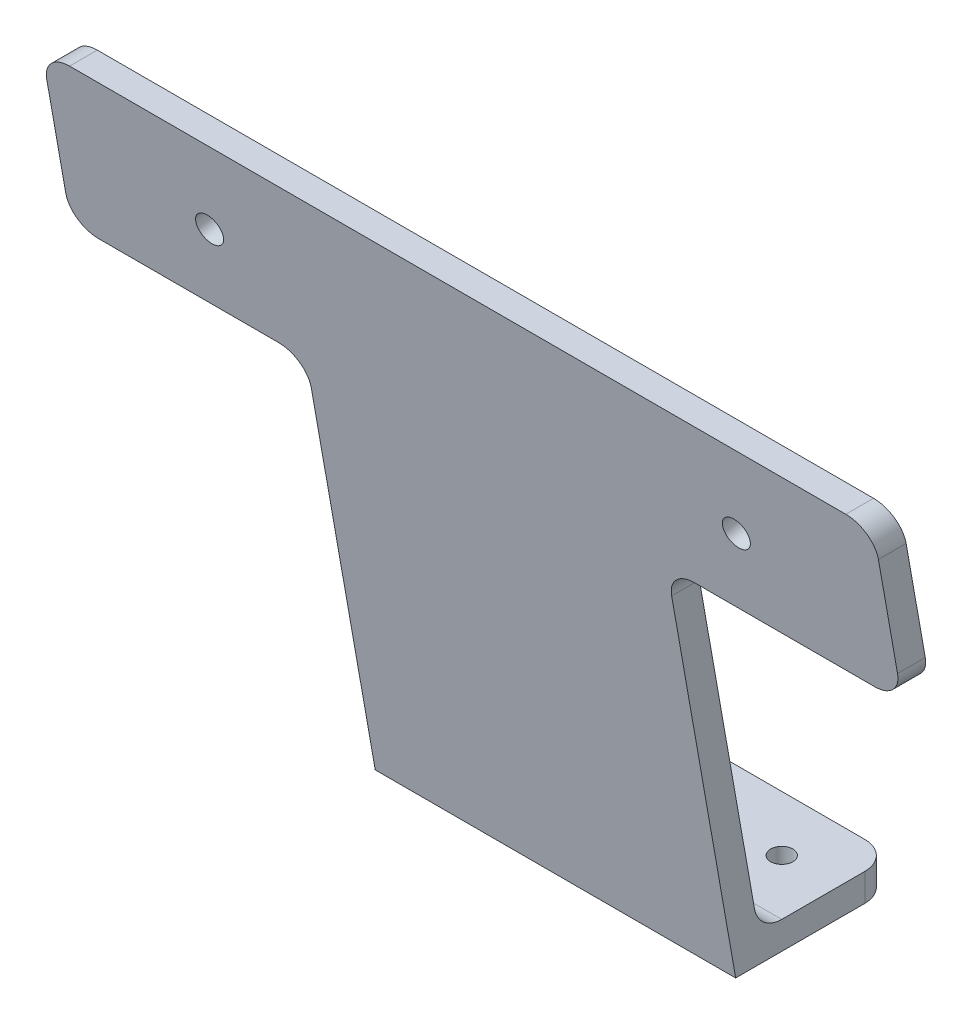
ISO-10303-21;
HEADER;
FILE_DESCRIPTION(('STEP AP214'),'2;1');
FILE_NAME('part.step','',(''),(''),'','','');
FILE_SCHEMA(('AUTOMOTIVE_DESIGN { 1 0 10303 214 1 1 1 1 }'));
ENDSEC;
DATA;
#1=APPLICATION_CONTEXT('core data for automotive mechanical design processes');
#2=APPLICATION_PROTOCOL_DEFINITION('international standard','automotive_design',2000,#1);
#3=PRODUCT_CONTEXT('',#1,'mechanical');
#4=PRODUCT('Part','Part','',(#3));
#5=PRODUCT_RELATED_PRODUCT_CATEGORY('part','',(#4));
#6=PRODUCT_DEFINITION_FORMATION('','',#4);
#7=PRODUCT_DEFINITION_CONTEXT('part definition',#1,'design');
#8=PRODUCT_DEFINITION('design','',#6,#7);
#9=PRODUCT_DEFINITION_SHAPE('','',#8);
#10=(LENGTH_UNIT() NAMED_UNIT(*) SI_UNIT(.MILLI.,.METRE.));
#11=(NAMED_UNIT(*) PLANE_ANGLE_UNIT() SI_UNIT($,.RADIAN.));
#12=(NAMED_UNIT(*) SI_UNIT($,.STERADIAN.) SOLID_ANGLE_UNIT());
#13=UNCERTAINTY_MEASURE_WITH_UNIT(LENGTH_MEASURE(1.E-05),#10,'distance_accuracy_value','');
#14=(GEOMETRIC_REPRESENTATION_CONTEXT(3) GLOBAL_UNCERTAINTY_ASSIGNED_CONTEXT((#13)) GLOBAL_UNIT_ASSIGNED_CONTEXT((#10,
#11,#12)) REPRESENTATION_CONTEXT('',''));
#15=CARTESIAN_POINT('',(0.,0.,0.));
#16=DIRECTION('',(0.,0.,1.));
#17=DIRECTION('',(1.,0.,0.));
#18=AXIS2_PLACEMENT_3D('',#15,#16,#17);
#19=CARTESIAN_POINT('',(65.,5.,-28.3));
#20=DIRECTION('',(0.,-1.,0.));
#21=DIRECTION('',(0.,0.,-1.));
#22=AXIS2_PLACEMENT_3D('',#19,#20,#21);
#23=PLANE('',#22);
#24=CARTESIAN_POINT('',(55.,5.,-18.3138632523441));
#25=DIRECTION('',(0.,1.,0.));
#26=DIRECTION('',(0.,0.,1.));
#27=AXIS2_PLACEMENT_3D('',#24,#25,#26);
#28=CIRCLE('',#27,2.);
#29=CARTESIAN_POINT('',(55.,5.,-16.3138632523441));
#30=VERTEX_POINT('',#29);
#31=EDGE_CURVE('E232',#30,#30,#28,.T.);
#32=ORIENTED_EDGE('',*,*,#31,.F.);
#33=EDGE_LOOP('',(#32));
#34=FACE_BOUND('',#33,.T.);
#35=CARTESIAN_POINT('',(10.,5.,-18.3138632523441));
#36=DIRECTION('',(0.,1.,0.));
#37=DIRECTION('',(0.,0.,1.));
#38=AXIS2_PLACEMENT_3D('',#35,#36,#37);
#39=CIRCLE('',#38,2.);
#40=CARTESIAN_POINT('',(10.,5.,-16.3138632523441));
#41=VERTEX_POINT('',#40);
#42=EDGE_CURVE('E233',#41,#41,#39,.T.);
#43=ORIENTED_EDGE('',*,*,#42,.F.);
#44=EDGE_LOOP('',(#43));
#45=FACE_BOUND('',#44,.T.);
#46=DIRECTION('',(0.,0.,1.));
#47=VECTOR('',#46,1.);
#48=CARTESIAN_POINT('',(36.5,5.,-25.1003449663359));
#49=LINE('',#48,#47);
#50=CARTESIAN_POINT('',(36.5,5.,-25.1003449663359));
#51=VERTEX_POINT('',#50);
#52=CARTESIAN_POINT('',(36.5,5.,-8.3138632523441));
#53=VERTEX_POINT('',#52);
#54=EDGE_CURVE('E220',#51,#53,#49,.T.);
#55=ORIENTED_EDGE('',*,*,#54,.T.);
#56=DIRECTION('',(-1.,0.,0.));
#57=VECTOR('',#56,1.);
#58=CARTESIAN_POINT('',(65.,5.,-8.3138632523441));
#59=LINE('',#58,#57);
#60=CARTESIAN_POINT('',(65.,5.,-8.3138632523441));
#61=VERTEX_POINT('',#60);
#62=EDGE_CURVE('E358',#53,#61,#59,.F.);
#63=ORIENTED_EDGE('',*,*,#62,.T.);
#64=DIRECTION('',(0.,0.,1.));
#65=VECTOR('',#64,1.);
#66=CARTESIAN_POINT('',(65.,5.,-28.3));
#67=LINE('',#66,#65);
#68=CARTESIAN_POINT('',(65.,5.,-23.3));
#69=VERTEX_POINT('',#68);
#70=EDGE_CURVE('E271',#69,#61,#67,.T.);
#71=ORIENTED_EDGE('',*,*,#70,.F.);
#72=CARTESIAN_POINT('',(60.,5.,-23.3));
#73=DIRECTION('',(0.,-1.,0.));
#74=DIRECTION('',(0.,0.,-1.));
#75=AXIS2_PLACEMENT_3D('',#72,#73,#74);
#76=CIRCLE('',#75,5.);
#77=CARTESIAN_POINT('',(60.,5.,-28.3));
#78=VERTEX_POINT('',#77);
#79=EDGE_CURVE('E362',#69,#78,#76,.F.);
#80=ORIENTED_EDGE('',*,*,#79,.T.);
#81=DIRECTION('',(-1.,0.,0.));
#82=VECTOR('',#81,1.);
#83=CARTESIAN_POINT('',(65.,5.,-28.3));
#84=LINE('',#83,#82);
#85=CARTESIAN_POINT('',(5.,5.,-28.3));
#86=VERTEX_POINT('',#85);
#87=EDGE_CURVE('E288',#78,#86,#84,.T.);
#88=ORIENTED_EDGE('',*,*,#87,.T.);
#89=CARTESIAN_POINT('',(5.,5.,-23.3));
#90=DIRECTION('',(0.,-1.,0.));
#91=DIRECTION('',(0.,0.,-1.));
#92=AXIS2_PLACEMENT_3D('',#89,#90,#91);
#93=CIRCLE('',#92,5.);
#94=CARTESIAN_POINT('',(0.,5.,-23.3));
#95=VERTEX_POINT('',#94);
#96=EDGE_CURVE('E364',#86,#95,#93,.F.);
#97=ORIENTED_EDGE('',*,*,#96,.T.);
#98=DIRECTION('',(0.,0.,1.));
#99=VECTOR('',#98,1.);
#100=CARTESIAN_POINT('',(0.,5.,-28.3));
#101=LINE('',#100,#99);
#102=CARTESIAN_POINT('',(0.,5.,-8.3138632523441));
#103=VERTEX_POINT('',#102);
#104=EDGE_CURVE('E281',#95,#103,#101,.T.);
#105=ORIENTED_EDGE('',*,*,#104,.T.);
#106=CARTESIAN_POINT('',(28.5,5.,-8.3138632523441));
#107=VERTEX_POINT('',#106);
#108=EDGE_CURVE('E359',#103,#107,#59,.F.);
#109=ORIENTED_EDGE('',*,*,#108,.T.);
#110=DIRECTION('',(0.,0.,1.));
#111=VECTOR('',#110,1.);
#112=CARTESIAN_POINT('',(28.5,5.,-25.1003449663359));
#113=LINE('',#112,#111);
#114=CARTESIAN_POINT('',(28.5,5.,-25.1003449663359));
#115=VERTEX_POINT('',#114);
#116=EDGE_CURVE('E55',#115,#107,#113,.T.);
#117=ORIENTED_EDGE('',*,*,#116,.F.);
#118=DIRECTION('',(-1.,0.,0.));
#119=VECTOR('',#118,1.);
#120=CARTESIAN_POINT('',(36.5,5.,-25.1003449663359));
#121=LINE('',#120,#119);
#122=EDGE_CURVE('E210',#51,#115,#121,.T.);
#123=ORIENTED_EDGE('',*,*,#122,.F.);
#124=EDGE_LOOP('',(#55,#63,#71,#80,#88,#97,#105,#109,#117,#123));
#125=FACE_BOUND('',#124,.T.);
#126=ADVANCED_FACE('F40',(#34,#45,#125),#23,.F.);
#127=CARTESIAN_POINT('',(65.,5.,-4.11836509645768));
#128=DIRECTION('',(0.,-0.173648177666927,0.984807753012208));
#129=DIRECTION('',(0.,-0.984807753012209,-0.173648177666927));
#130=AXIS2_PLACEMENT_3D('',#127,#128,#129);
#131=PLANE('',#130);
#132=CARTESIAN_POINT('',(80.,85.2278837048169,10.0279754058423));
#133=DIRECTION('',(0.,0.173648177666927,-0.984807753012209));
#134=DIRECTION('',(0.,0.984807753012209,0.173648177666927));
#135=AXIS2_PLACEMENT_3D('',#132,#133,#134);
#136=CIRCLE('',#135,2.50000000000001);
#137=CARTESIAN_POINT('',(80.,87.6899030873474,10.4620958500096));
#138=VERTEX_POINT('',#137);
#139=EDGE_CURVE('E215',#138,#138,#136,.T.);
#140=ORIENTED_EDGE('',*,*,#139,.F.);
#141=EDGE_LOOP('',(#140));
#142=FACE_BOUND('',#141,.T.);
#143=CARTESIAN_POINT('',(-15.,85.2278837048169,10.0279754058423));
#144=DIRECTION('',(0.,0.173648177666927,-0.984807753012209));
#145=DIRECTION('',(0.,0.984807753012209,0.173648177666927));
#146=AXIS2_PLACEMENT_3D('',#143,#144,#145);
#147=CIRCLE('',#146,2.5);
#148=CARTESIAN_POINT('',(-15.,87.6899030873474,10.4620958500096));
#149=VERTEX_POINT('',#148);
#150=EDGE_CURVE('E218',#149,#149,#147,.T.);
#151=ORIENTED_EDGE('',*,*,#150,.F.);
#152=EDGE_LOOP('',(#151));
#153=FACE_BOUND('',#152,.T.);
#154=DIRECTION('',(0.,-0.984807753012209,-0.173648177666927));
#155=VECTOR('',#154,1.);
#156=CARTESIAN_POINT('',(36.5,68.7967511661238,7.13072341567398));
#157=LINE('',#156,#155);
#158=CARTESIAN_POINT('',(36.5,68.7967511661238,7.13072341567398));
#159=VERTEX_POINT('',#158);
#160=CARTESIAN_POINT('',(36.5,9.13175911166536,-3.38982448728305));
#161=VERTEX_POINT('',#160);
#162=EDGE_CURVE('E214',#159,#161,#157,.T.);
#163=ORIENTED_EDGE('',*,*,#162,.F.);
#164=DIRECTION('',(-1.,0.,0.));
#165=VECTOR('',#164,1.);
#166=CARTESIAN_POINT('',(36.5,68.7967511661238,7.13072341567398));
#167=LINE('',#166,#165);
#168=CARTESIAN_POINT('',(28.5,68.7967511661238,7.13072341567398));
#169=VERTEX_POINT('',#168);
#170=EDGE_CURVE('E207',#159,#169,#167,.T.);
#171=ORIENTED_EDGE('',*,*,#170,.T.);
#172=DIRECTION('',(0.,-0.984807753012209,-0.173648177666927));
#173=VECTOR('',#172,1.);
#174=CARTESIAN_POINT('',(28.5,68.7967511661238,7.13072341567398));
#175=LINE('',#174,#173);
#176=CARTESIAN_POINT('',(28.5,9.13175911166536,-3.38982448728305));
#177=VERTEX_POINT('',#176);
#178=EDGE_CURVE('E195',#169,#177,#175,.T.);
#179=ORIENTED_EDGE('',*,*,#178,.T.);
#180=DIRECTION('',(-1.,0.,0.));
#181=VECTOR('',#180,1.);
#182=CARTESIAN_POINT('',(0.,9.13175911166536,-3.38982448728306));
#183=LINE('',#182,#181);
#184=CARTESIAN_POINT('',(0.,9.13175911166536,-3.38982448728305));
#185=VERTEX_POINT('',#184);
#186=EDGE_CURVE('E332',#177,#185,#183,.T.);
#187=ORIENTED_EDGE('',*,*,#186,.T.);
#188=DIRECTION('',(0.,0.984807753012209,0.173648177666927));
#189=VECTOR('',#188,1.);
#190=CARTESIAN_POINT('',(0.,5.,-4.11836509645768));
#191=LINE('',#190,#189);
#192=CARTESIAN_POINT('',(0.,65.4557674096337,6.54161783729606));
#193=VERTEX_POINT('',#192);
#194=EDGE_CURVE('E268',#185,#193,#191,.T.);
#195=ORIENTED_EDGE('',*,*,#194,.T.);
#196=CARTESIAN_POINT('',(-5.,65.4557674096337,6.54161783729607));
#197=DIRECTION('',(0.,-0.173648177666927,0.984807753012208));
#198=DIRECTION('',(0.,-0.984807753012209,-0.173648177666927));
#199=AXIS2_PLACEMENT_3D('',#196,#197,#198);
#200=ELLIPSE('',#199,5.07713305942872,5.);
#201=CARTESIAN_POINT('',(-5.00000000000001,70.4557674096337,7.42325274083838));
#202=VERTEX_POINT('',#201);
#203=EDGE_CURVE('E371',#193,#202,#200,.T.);
#204=ORIENTED_EDGE('',*,*,#203,.T.);
#205=DIRECTION('',(-1.,0.,0.));
#206=VECTOR('',#205,1.);
#207=CARTESIAN_POINT('',(-42.5,70.4557674096337,7.42325274083838));
#208=LINE('',#207,#206);
#209=CARTESIAN_POINT('',(-37.5,70.4557674096337,7.42325274083838));
#210=VERTEX_POINT('',#209);
#211=EDGE_CURVE('E252',#202,#210,#208,.T.);
#212=ORIENTED_EDGE('',*,*,#211,.T.);
#213=CARTESIAN_POINT('',(-37.5,75.4557674096337,8.30488764438067));
#214=DIRECTION('',(0.,-0.173648177666927,0.984807753012208));
#215=DIRECTION('',(0.,0.984807753012209,0.173648177666927));
#216=AXIS2_PLACEMENT_3D('',#213,#214,#215);
#217=ELLIPSE('',#216,5.07713305942872,5.);
#218=CARTESIAN_POINT('',(-42.5,75.4557674096337,8.30488764438068));
#219=VERTEX_POINT('',#218);
#220=EDGE_CURVE('E335',#210,#219,#217,.F.);
#221=ORIENTED_EDGE('',*,*,#220,.T.);
#222=DIRECTION('',(0.,0.984807753012209,0.173648177666927));
#223=VECTOR('',#222,1.);
#224=CARTESIAN_POINT('',(-42.5,73.6387129172025,7.98449191194753));
#225=LINE('',#224,#223);
#226=CARTESIAN_POINT('',(-42.5,95.,11.7510631673039));
#227=VERTEX_POINT('',#226);
#228=EDGE_CURVE('E248',#219,#227,#225,.T.);
#229=ORIENTED_EDGE('',*,*,#228,.T.);
#230=CARTESIAN_POINT('',(-37.5,95.,11.7510631673039));
#231=DIRECTION('',(0.,-0.173648177666927,0.984807753012208));
#232=DIRECTION('',(0.,-0.984807753012209,-0.173648177666927));
#233=AXIS2_PLACEMENT_3D('',#230,#231,#232);
#234=ELLIPSE('',#233,5.07713305942872,5.);
#235=CARTESIAN_POINT('',(-37.5,100.,12.6326980708462));
#236=VERTEX_POINT('',#235);
#237=EDGE_CURVE('E337',#227,#236,#234,.F.);
#238=ORIENTED_EDGE('',*,*,#237,.T.);
#239=DIRECTION('',(-1.,0.,0.));
#240=VECTOR('',#239,1.);
#241=CARTESIAN_POINT('',(65.,100.,12.6326980708462));
#242=LINE('',#241,#240);
#243=CARTESIAN_POINT('',(102.5,100.,12.6326980708462));
#244=VERTEX_POINT('',#243);
#245=EDGE_CURVE('E277',#244,#236,#242,.T.);
#246=ORIENTED_EDGE('',*,*,#245,.F.);
#247=CARTESIAN_POINT('',(102.5,95.,11.7510631673039));
#248=DIRECTION('',(0.,-0.173648177666927,0.984807753012208));
#249=DIRECTION('',(0.,-0.984807753012209,-0.173648177666927));
#250=AXIS2_PLACEMENT_3D('',#247,#248,#249);
#251=ELLIPSE('',#250,5.07713305942872,5.);
#252=CARTESIAN_POINT('',(107.5,95.,11.7510631673039));
#253=VERTEX_POINT('',#252);
#254=EDGE_CURVE('E339',#244,#253,#251,.F.);
#255=ORIENTED_EDGE('',*,*,#254,.T.);
#256=DIRECTION('',(0.,-0.984807753012209,-0.173648177666927));
#257=VECTOR('',#256,1.);
#258=CARTESIAN_POINT('',(107.5,73.6387129172025,7.98449191194753));
#259=LINE('',#258,#257);
#260=CARTESIAN_POINT('',(107.5,75.4557674096337,8.30488764438068));
#261=VERTEX_POINT('',#260);
#262=EDGE_CURVE('E245',#253,#261,#259,.T.);
#263=ORIENTED_EDGE('',*,*,#262,.T.);
#264=CARTESIAN_POINT('',(102.5,75.4557674096337,8.30488764438067));
#265=DIRECTION('',(0.,-0.173648177666927,0.984807753012208));
#266=DIRECTION('',(0.,0.984807753012209,0.173648177666927));
#267=AXIS2_PLACEMENT_3D('',#264,#265,#266);
#268=ELLIPSE('',#267,5.07713305942872,5.);
#269=CARTESIAN_POINT('',(102.5,70.4557674096337,7.42325274083838));
#270=VERTEX_POINT('',#269);
#271=EDGE_CURVE('E341',#261,#270,#268,.F.);
#272=ORIENTED_EDGE('',*,*,#271,.T.);
#273=CARTESIAN_POINT('',(70.,70.4557674096337,7.42325274083838));
#274=VERTEX_POINT('',#273);
#275=EDGE_CURVE('E261',#270,#274,#208,.T.);
#276=ORIENTED_EDGE('',*,*,#275,.T.);
#277=CARTESIAN_POINT('',(70.,65.4557674096337,6.54161783729605));
#278=DIRECTION('',(0.,-0.173648177666927,0.984807753012208));
#279=DIRECTION('',(0.,0.984807753012209,0.173648177666927));
#280=AXIS2_PLACEMENT_3D('',#277,#278,#279);
#281=ELLIPSE('',#280,5.07713305942872,5.);
#282=CARTESIAN_POINT('',(65.,65.4557674096337,6.54161783729606));
#283=VERTEX_POINT('',#282);
#284=EDGE_CURVE('E375',#274,#283,#281,.T.);
#285=ORIENTED_EDGE('',*,*,#284,.T.);
#286=DIRECTION('',(0.,0.984807753012209,0.173648177666927));
#287=VECTOR('',#286,1.);
#288=CARTESIAN_POINT('',(65.,5.,-4.11836509645768));
#289=LINE('',#288,#287);
#290=CARTESIAN_POINT('',(65.,9.13175911166536,-3.38982448728305));
#291=VERTEX_POINT('',#290);
#292=EDGE_CURVE('E274',#291,#283,#289,.T.);
#293=ORIENTED_EDGE('',*,*,#292,.F.);
#294=EDGE_CURVE('E333',#291,#161,#183,.T.);
#295=ORIENTED_EDGE('',*,*,#294,.T.);
#296=EDGE_LOOP('',(#163,#171,#179,#187,#195,#204,#212,#221,#229,#238,#246,#255,#263,#272,#276,
#285,#293,#295));
#297=FACE_BOUND('',#296,.T.);
#298=ADVANCED_FACE('F212',(#142,#153,#297),#131,.F.);
#299=CARTESIAN_POINT('',(65.,10.,-8.3138632523441));
#300=DIRECTION('',(1.,0.,0.));
#301=DIRECTION('',(0.,0.,-1.));
#302=AXIS2_PLACEMENT_3D('',#299,#300,#301);
#303=CYLINDRICAL_SURFACE('',#302,5.);
#304=CARTESIAN_POINT('',(36.5,10.,-8.3138632523441));
#305=DIRECTION('',(-1.,0.,0.));
#306=DIRECTION('',(0.,0.,1.));
#307=AXIS2_PLACEMENT_3D('',#304,#305,#306);
#308=CIRCLE('',#307,5.);
#309=EDGE_CURVE('E393',#53,#161,#308,.T.);
#310=ORIENTED_EDGE('',*,*,#309,.T.);
#311=ORIENTED_EDGE('',*,*,#294,.F.);
#312=CARTESIAN_POINT('',(65.,10.,-8.3138632523441));
#313=DIRECTION('',(-1.,0.,0.));
#314=DIRECTION('',(0.,0.,1.));
#315=AXIS2_PLACEMENT_3D('',#312,#313,#314);
#316=CIRCLE('',#315,5.);
#317=EDGE_CURVE('E11',#61,#291,#316,.T.);
#318=ORIENTED_EDGE('',*,*,#317,.F.);
#319=ORIENTED_EDGE('',*,*,#62,.F.);
#320=EDGE_LOOP('',(#310,#311,#318,#319));
#321=FACE_BOUND('',#320,.T.);
#322=ADVANCED_FACE('F401',(#321),#303,.F.);
#323=CARTESIAN_POINT('',(65.,100.,12.6326980708462));
#324=DIRECTION('',(0.,-1.,0.));
#325=DIRECTION('',(0.,0.,-1.));
#326=AXIS2_PLACEMENT_3D('',#323,#324,#325);
#327=PLANE('',#326);
#328=DIRECTION('',(-1.,0.,0.));
#329=VECTOR('',#328,1.);
#330=CARTESIAN_POINT('',(65.,100.,17.6326980708462));
#331=LINE('',#330,#329);
#332=CARTESIAN_POINT('',(102.5,100.,17.6326980708462));
#333=VERTEX_POINT('',#332);
#334=CARTESIAN_POINT('',(-37.5,100.,17.6326980708462));
#335=VERTEX_POINT('',#334);
#336=EDGE_CURVE('E296',#333,#335,#331,.T.);
#337=ORIENTED_EDGE('',*,*,#336,.F.);
#338=DIRECTION('',(0.,0.,1.));
#339=VECTOR('',#338,1.);
#340=CARTESIAN_POINT('',(102.5,100.,12.6326980708462));
#341=LINE('',#340,#339);
#342=EDGE_CURVE('E346',#333,#244,#341,.F.);
#343=ORIENTED_EDGE('',*,*,#342,.T.);
#344=ORIENTED_EDGE('',*,*,#245,.T.);
#345=DIRECTION('',(0.,0.,1.));
#346=VECTOR('',#345,1.);
#347=CARTESIAN_POINT('',(-37.5,100.,17.6326980708462));
#348=LINE('',#347,#346);
#349=EDGE_CURVE('E343',#236,#335,#348,.T.);
#350=ORIENTED_EDGE('',*,*,#349,.T.);
#351=EDGE_LOOP('',(#337,#343,#344,#350));
#352=FACE_BOUND('',#351,.T.);
#353=ADVANCED_FACE('F460',(#352),#327,.F.);
#354=CARTESIAN_POINT('',(65.,100.,17.6326980708462));
#355=DIRECTION('',(0.,0.173648177666927,-0.984807753012208));
#356=DIRECTION('',(0.,0.984807753012209,0.173648177666927));
#357=AXIS2_PLACEMENT_3D('',#354,#355,#356);
#358=PLANE('',#357);
#359=CARTESIAN_POINT('',(-15.,84.3728333465027,14.877206957807));
#360=DIRECTION('',(0.,0.173648177666927,-0.984807753012208));
#361=DIRECTION('',(0.,0.984807753012209,0.173648177666927));
#362=AXIS2_PLACEMENT_3D('',#359,#360,#361);
#363=CIRCLE('',#362,2.5);
#364=CARTESIAN_POINT('',(-15.,86.8348527290332,15.3113274019744));
#365=VERTEX_POINT('',#364);
#366=EDGE_CURVE('E229',#365,#365,#363,.T.);
#367=ORIENTED_EDGE('',*,*,#366,.T.);
#368=EDGE_LOOP('',(#367));
#369=FACE_BOUND('',#368,.T.);
#370=CARTESIAN_POINT('',(80.,84.3728333465027,14.877206957807));
#371=DIRECTION('',(0.,0.173648177666927,-0.984807753012208));
#372=DIRECTION('',(0.,0.984807753012209,0.173648177666927));
#373=AXIS2_PLACEMENT_3D('',#370,#371,#372);
#374=CIRCLE('',#373,2.50000000000001);
#375=CARTESIAN_POINT('',(80.,86.8348527290332,15.3113274019744));
#376=VERTEX_POINT('',#375);
#377=EDGE_CURVE('E225',#376,#376,#374,.T.);
#378=ORIENTED_EDGE('',*,*,#377,.T.);
#379=EDGE_LOOP('',(#378));
#380=FACE_BOUND('',#379,.T.);
#381=DIRECTION('',(1.,0.,0.));
#382=VECTOR('',#381,1.);
#383=CARTESIAN_POINT('',(-42.5,70.4557674096337,12.4232527408384));
#384=LINE('',#383,#382);
#385=CARTESIAN_POINT('',(70.,70.4557674096337,12.4232527408384));
#386=VERTEX_POINT('',#385);
#387=CARTESIAN_POINT('',(102.5,70.4557674096337,12.4232527408384));
#388=VERTEX_POINT('',#387);
#389=EDGE_CURVE('E255',#386,#388,#384,.T.);
#390=ORIENTED_EDGE('',*,*,#389,.T.);
#391=CARTESIAN_POINT('',(102.5,75.4557674096337,13.3048876443807));
#392=DIRECTION('',(0.,0.173648177666927,-0.984807753012208));
#393=DIRECTION('',(0.,0.984807753012209,0.173648177666927));
#394=AXIS2_PLACEMENT_3D('',#391,#392,#393);
#395=ELLIPSE('',#394,5.07713305942872,5.);
#396=CARTESIAN_POINT('',(107.5,75.4557674096338,13.3048876443807));
#397=VERTEX_POINT('',#396);
#398=EDGE_CURVE('E325',#388,#397,#395,.F.);
#399=ORIENTED_EDGE('',*,*,#398,.T.);
#400=DIRECTION('',(0.,0.984807753012208,0.173648177666927));
#401=VECTOR('',#400,1.);
#402=CARTESIAN_POINT('',(107.5,100.,17.6326980708462));
#403=LINE('',#402,#401);
#404=CARTESIAN_POINT('',(107.5,95.,16.7510631673039));
#405=VERTEX_POINT('',#404);
#406=EDGE_CURVE('E249',#397,#405,#403,.T.);
#407=ORIENTED_EDGE('',*,*,#406,.T.);
#408=CARTESIAN_POINT('',(102.5,95.,16.7510631673039));
#409=DIRECTION('',(0.,0.173648177666927,-0.984807753012208));
#410=DIRECTION('',(0.,-0.984807753012209,-0.173648177666927));
#411=AXIS2_PLACEMENT_3D('',#408,#409,#410);
#412=ELLIPSE('',#411,5.07713305942872,5.);
#413=EDGE_CURVE('E323',#405,#333,#412,.F.);
#414=ORIENTED_EDGE('',*,*,#413,.T.);
#415=ORIENTED_EDGE('',*,*,#336,.T.);
#416=CARTESIAN_POINT('',(-37.5,95.,16.7510631673039));
#417=DIRECTION('',(0.,0.173648177666927,-0.984807753012208));
#418=DIRECTION('',(0.,-0.984807753012209,-0.173648177666927));
#419=AXIS2_PLACEMENT_3D('',#416,#417,#418);
#420=ELLIPSE('',#419,5.07713305942872,5.);
#421=CARTESIAN_POINT('',(-42.5,95.,16.7510631673039));
#422=VERTEX_POINT('',#421);
#423=EDGE_CURVE('E321',#335,#422,#420,.F.);
#424=ORIENTED_EDGE('',*,*,#423,.T.);
#425=DIRECTION('',(0.,-0.984807753012208,-0.173648177666927));
#426=VECTOR('',#425,1.);
#427=CARTESIAN_POINT('',(-42.5,100.,17.6326980708462));
#428=LINE('',#427,#426);
#429=CARTESIAN_POINT('',(-42.5,75.4557674096338,13.3048876443807));
#430=VERTEX_POINT('',#429);
#431=EDGE_CURVE('E240',#422,#430,#428,.T.);
#432=ORIENTED_EDGE('',*,*,#431,.T.);
#433=CARTESIAN_POINT('',(-37.5,75.4557674096337,13.3048876443807));
#434=DIRECTION('',(0.,0.173648177666927,-0.984807753012208));
#435=DIRECTION('',(0.,0.984807753012209,0.173648177666927));
#436=AXIS2_PLACEMENT_3D('',#433,#434,#435);
#437=ELLIPSE('',#436,5.07713305942872,5.);
#438=CARTESIAN_POINT('',(-37.5,70.4557674096337,12.4232527408384));
#439=VERTEX_POINT('',#438);
#440=EDGE_CURVE('E319',#430,#439,#437,.F.);
#441=ORIENTED_EDGE('',*,*,#440,.T.);
#442=CARTESIAN_POINT('',(-5.,70.4557674096337,12.4232527408384));
#443=VERTEX_POINT('',#442);
#444=EDGE_CURVE('E258',#439,#443,#384,.T.);
#445=ORIENTED_EDGE('',*,*,#444,.T.);
#446=CARTESIAN_POINT('',(-5.,65.4557674096337,11.541617837296));
#447=DIRECTION('',(0.,0.173648177666927,-0.984807753012208));
#448=DIRECTION('',(0.,-0.984807753012209,-0.173648177666927));
#449=AXIS2_PLACEMENT_3D('',#446,#447,#448);
#450=ELLIPSE('',#449,5.07713305942872,5.);
#451=CARTESIAN_POINT('',(0.,65.4557674096337,11.5416178372961));
#452=VERTEX_POINT('',#451);
#453=EDGE_CURVE('E369',#443,#452,#450,.T.);
#454=ORIENTED_EDGE('',*,*,#453,.T.);
#455=DIRECTION('',(0.,-0.984807753012209,-0.173648177666927));
#456=VECTOR('',#455,1.);
#457=CARTESIAN_POINT('',(0.,100.,17.6326980708462));
#458=LINE('',#457,#456);
#459=CARTESIAN_POINT('',(0.,0.,0.));
#460=VERTEX_POINT('',#459);
#461=EDGE_CURVE('E264',#452,#460,#458,.T.);
#462=ORIENTED_EDGE('',*,*,#461,.T.);
#463=DIRECTION('',(-1.,0.,0.));
#464=VECTOR('',#463,1.);
#465=CARTESIAN_POINT('',(65.,0.,0.));
#466=LINE('',#465,#464);
#467=CARTESIAN_POINT('',(65.,0.,0.));
#468=VERTEX_POINT('',#467);
#469=EDGE_CURVE('E293',#468,#460,#466,.T.);
#470=ORIENTED_EDGE('',*,*,#469,.F.);
#471=DIRECTION('',(0.,-0.984807753012209,-0.173648177666927));
#472=VECTOR('',#471,1.);
#473=CARTESIAN_POINT('',(65.,100.,17.6326980708462));
#474=LINE('',#473,#472);
#475=CARTESIAN_POINT('',(65.,65.4557674096337,11.5416178372961));
#476=VERTEX_POINT('',#475);
#477=EDGE_CURVE('E265',#476,#468,#474,.T.);
#478=ORIENTED_EDGE('',*,*,#477,.F.);
#479=CARTESIAN_POINT('',(70.,65.4557674096337,11.5416178372961));
#480=DIRECTION('',(0.,0.173648177666927,-0.984807753012208));
#481=DIRECTION('',(0.,0.984807753012209,0.173648177666927));
#482=AXIS2_PLACEMENT_3D('',#479,#480,#481);
#483=ELLIPSE('',#482,5.07713305942872,5.);
#484=EDGE_CURVE('E373',#476,#386,#483,.T.);
#485=ORIENTED_EDGE('',*,*,#484,.T.);
#486=EDGE_LOOP('',(#390,#399,#407,#414,#415,#424,#432,#441,#445,#454,#462,#470,#478,#485));
#487=FACE_BOUND('',#486,.T.);
#488=ADVANCED_FACE('F415',(#369,#380,#487),#358,.F.);
#489=CARTESIAN_POINT('',(65.,0.,0.));
#490=DIRECTION('',(0.,1.,0.));
#491=DIRECTION('',(0.,0.,1.));
#492=AXIS2_PLACEMENT_3D('',#489,#490,#491);
#493=PLANE('',#492);
#494=CARTESIAN_POINT('',(10.,0.,-18.3138632523441));
#495=DIRECTION('',(0.,1.,0.));
#496=DIRECTION('',(0.,0.,1.));
#497=AXIS2_PLACEMENT_3D('',#494,#495,#496);
#498=CIRCLE('',#497,2.);
#499=CARTESIAN_POINT('',(10.,0.,-16.3138632523441));
#500=VERTEX_POINT('',#499);
#501=EDGE_CURVE('E236',#500,#500,#498,.F.);
#502=ORIENTED_EDGE('',*,*,#501,.F.);
#503=EDGE_LOOP('',(#502));
#504=FACE_BOUND('',#503,.T.);
#505=CARTESIAN_POINT('',(55.,0.,-18.3138632523441));
#506=DIRECTION('',(0.,1.,0.));
#507=DIRECTION('',(0.,0.,1.));
#508=AXIS2_PLACEMENT_3D('',#505,#506,#507);
#509=CIRCLE('',#508,2.);
#510=CARTESIAN_POINT('',(55.,0.,-16.3138632523441));
#511=VERTEX_POINT('',#510);
#512=EDGE_CURVE('E237',#511,#511,#509,.F.);
#513=ORIENTED_EDGE('',*,*,#512,.F.);
#514=EDGE_LOOP('',(#513));
#515=FACE_BOUND('',#514,.T.);
#516=DIRECTION('',(0.,0.,-1.));
#517=VECTOR('',#516,1.);
#518=CARTESIAN_POINT('',(0.,0.,0.));
#519=LINE('',#518,#517);
#520=CARTESIAN_POINT('',(0.,0.,-23.3));
#521=VERTEX_POINT('',#520);
#522=EDGE_CURVE('E279',#460,#521,#519,.T.);
#523=ORIENTED_EDGE('',*,*,#522,.T.);
#524=CARTESIAN_POINT('',(5.,0.,-23.3));
#525=DIRECTION('',(0.,1.,0.));
#526=DIRECTION('',(0.,0.,1.));
#527=AXIS2_PLACEMENT_3D('',#524,#525,#526);
#528=CIRCLE('',#527,5.);
#529=CARTESIAN_POINT('',(5.,0.,-28.3));
#530=VERTEX_POINT('',#529);
#531=EDGE_CURVE('E63',#521,#530,#528,.F.);
#532=ORIENTED_EDGE('',*,*,#531,.T.);
#533=DIRECTION('',(-1.,0.,0.));
#534=VECTOR('',#533,1.);
#535=CARTESIAN_POINT('',(65.,0.,-28.3));
#536=LINE('',#535,#534);
#537=CARTESIAN_POINT('',(60.,0.,-28.3));
#538=VERTEX_POINT('',#537);
#539=EDGE_CURVE('E291',#538,#530,#536,.T.);
#540=ORIENTED_EDGE('',*,*,#539,.F.);
#541=CARTESIAN_POINT('',(60.,0.,-23.3));
#542=DIRECTION('',(0.,1.,0.));
#543=DIRECTION('',(0.,0.,1.));
#544=AXIS2_PLACEMENT_3D('',#541,#542,#543);
#545=CIRCLE('',#544,5.);
#546=CARTESIAN_POINT('',(65.,0.,-23.3));
#547=VERTEX_POINT('',#546);
#548=EDGE_CURVE('E366',#538,#547,#545,.F.);
#549=ORIENTED_EDGE('',*,*,#548,.T.);
#550=DIRECTION('',(0.,0.,-1.));
#551=VECTOR('',#550,1.);
#552=CARTESIAN_POINT('',(65.,0.,0.));
#553=LINE('',#552,#551);
#554=EDGE_CURVE('E267',#468,#547,#553,.T.);
#555=ORIENTED_EDGE('',*,*,#554,.F.);
#556=ORIENTED_EDGE('',*,*,#469,.T.);
#557=EDGE_LOOP('',(#523,#532,#540,#549,#555,#556));
#558=FACE_BOUND('',#557,.T.);
#559=ADVANCED_FACE('F419',(#504,#515,#558),#493,.F.);
#560=CARTESIAN_POINT('',(65.,0.,-28.3));
#561=DIRECTION('',(0.,0.,1.));
#562=DIRECTION('',(1.,0.,0.));
#563=AXIS2_PLACEMENT_3D('',#560,#561,#562);
#564=PLANE('',#563);
#565=ORIENTED_EDGE('',*,*,#539,.T.);
#566=DIRECTION('',(0.,1.,0.));
#567=VECTOR('',#566,1.);
#568=CARTESIAN_POINT('',(5.,5.,-28.3));
#569=LINE('',#568,#567);
#570=EDGE_CURVE('E355',#530,#86,#569,.T.);
#571=ORIENTED_EDGE('',*,*,#570,.T.);
#572=ORIENTED_EDGE('',*,*,#87,.F.);
#573=DIRECTION('',(0.,1.,0.));
#574=VECTOR('',#573,1.);
#575=CARTESIAN_POINT('',(60.,0.,-28.3));
#576=LINE('',#575,#574);
#577=EDGE_CURVE('E353',#78,#538,#576,.F.);
#578=ORIENTED_EDGE('',*,*,#577,.T.);
#579=EDGE_LOOP('',(#565,#571,#572,#578));
#580=FACE_BOUND('',#579,.T.);
#581=ADVANCED_FACE('F427',(#580),#564,.F.);
#582=CARTESIAN_POINT('',(65.,0.,0.));
#583=DIRECTION('',(-1.,0.,0.));
#584=DIRECTION('',(0.,0.,1.));
#585=AXIS2_PLACEMENT_3D('',#582,#583,#584);
#586=PLANE('',#585);
#587=ORIENTED_EDGE('',*,*,#292,.T.);
#588=DIRECTION('',(0.,0.,1.));
#589=VECTOR('',#588,1.);
#590=CARTESIAN_POINT('',(65.,65.4557674096337,0.));
#591=LINE('',#590,#589);
#592=EDGE_CURVE('E311',#283,#476,#591,.T.);
#593=ORIENTED_EDGE('',*,*,#592,.T.);
#594=ORIENTED_EDGE('',*,*,#477,.T.);
#595=ORIENTED_EDGE('',*,*,#554,.T.);
#596=DIRECTION('',(0.,1.,0.));
#597=VECTOR('',#596,1.);
#598=CARTESIAN_POINT('',(65.,0.,-23.3));
#599=LINE('',#598,#597);
#600=EDGE_CURVE('E308',#547,#69,#599,.T.);
#601=ORIENTED_EDGE('',*,*,#600,.T.);
#602=ORIENTED_EDGE('',*,*,#70,.T.);
#603=ORIENTED_EDGE('',*,*,#317,.T.);
#604=EDGE_LOOP('',(#587,#593,#594,#595,#601,#602,#603));
#605=FACE_BOUND('',#604,.T.);
#606=ADVANCED_FACE('F405',(#605),#586,.F.);
#607=CARTESIAN_POINT('',(0.,0.,0.));
#608=DIRECTION('',(-1.,0.,0.));
#609=DIRECTION('',(0.,0.,1.));
#610=AXIS2_PLACEMENT_3D('',#607,#608,#609);
#611=PLANE('',#610);
#612=ORIENTED_EDGE('',*,*,#461,.F.);
#613=DIRECTION('',(0.,0.,1.));
#614=VECTOR('',#613,1.);
#615=CARTESIAN_POINT('',(0.,65.4557674096337,7.42325274083838));
#616=LINE('',#615,#614);
#617=EDGE_CURVE('E306',#452,#193,#616,.F.);
#618=ORIENTED_EDGE('',*,*,#617,.T.);
#619=ORIENTED_EDGE('',*,*,#194,.F.);
#620=CARTESIAN_POINT('',(0.,10.,-8.3138632523441));
#621=DIRECTION('',(-1.,0.,0.));
#622=DIRECTION('',(0.,0.,1.));
#623=AXIS2_PLACEMENT_3D('',#620,#621,#622);
#624=CIRCLE('',#623,5.);
#625=EDGE_CURVE('E48',#185,#103,#624,.F.);
#626=ORIENTED_EDGE('',*,*,#625,.T.);
#627=ORIENTED_EDGE('',*,*,#104,.F.);
#628=DIRECTION('',(0.,1.,0.));
#629=VECTOR('',#628,1.);
#630=CARTESIAN_POINT('',(0.,0.,-23.3));
#631=LINE('',#630,#629);
#632=EDGE_CURVE('E304',#95,#521,#631,.F.);
#633=ORIENTED_EDGE('',*,*,#632,.T.);
#634=ORIENTED_EDGE('',*,*,#522,.F.);
#635=EDGE_LOOP('',(#612,#618,#619,#626,#627,#633,#634));
#636=FACE_BOUND('',#635,.T.);
#637=ADVANCED_FACE('F381',(#636),#611,.T.);
#638=CARTESIAN_POINT('',(-42.5,100.,-141.517796262448));
#639=DIRECTION('',(-1.,0.,0.));
#640=DIRECTION('',(0.,-1.,0.));
#641=AXIS2_PLACEMENT_3D('',#638,#639,#640);
#642=PLANE('',#641);
#643=ORIENTED_EDGE('',*,*,#431,.F.);
#644=DIRECTION('',(0.,0.,1.));
#645=VECTOR('',#644,1.);
#646=CARTESIAN_POINT('',(-42.5,95.,12.6326980708462));
#647=LINE('',#646,#645);
#648=EDGE_CURVE('E351',#422,#227,#647,.F.);
#649=ORIENTED_EDGE('',*,*,#648,.T.);
#650=ORIENTED_EDGE('',*,*,#228,.F.);
#651=DIRECTION('',(0.,0.,1.));
#652=VECTOR('',#651,1.);
#653=CARTESIAN_POINT('',(-42.5,75.4557674096337,-141.517796262448));
#654=LINE('',#653,#652);
#655=EDGE_CURVE('E348',#219,#430,#654,.T.);
#656=ORIENTED_EDGE('',*,*,#655,.T.);
#657=EDGE_LOOP('',(#643,#649,#650,#656));
#658=FACE_BOUND('',#657,.T.);
#659=ADVANCED_FACE('F451',(#658),#642,.T.);
#660=CARTESIAN_POINT('',(-42.5,70.4557674096337,-146.727241592456));
#661=DIRECTION('',(0.,-1.,0.));
#662=DIRECTION('',(0.,0.,-1.));
#663=AXIS2_PLACEMENT_3D('',#660,#661,#662);
#664=PLANE('',#663);
#665=ORIENTED_EDGE('',*,*,#211,.F.);
#666=DIRECTION('',(0.,0.,1.));
#667=VECTOR('',#666,1.);
#668=CARTESIAN_POINT('',(-5.,70.4557674096337,12.4232527408384));
#669=LINE('',#668,#667);
#670=EDGE_CURVE('E301',#202,#443,#669,.T.);
#671=ORIENTED_EDGE('',*,*,#670,.T.);
#672=ORIENTED_EDGE('',*,*,#444,.F.);
#673=DIRECTION('',(0.,0.,1.));
#674=VECTOR('',#673,1.);
#675=CARTESIAN_POINT('',(-37.5,70.4557674096337,-146.727241592456));
#676=LINE('',#675,#674);
#677=EDGE_CURVE('E299',#439,#210,#676,.F.);
#678=ORIENTED_EDGE('',*,*,#677,.T.);
#679=EDGE_LOOP('',(#665,#671,#672,#678));
#680=FACE_BOUND('',#679,.T.);
#681=ADVANCED_FACE('F440',(#680),#664,.T.);
#682=ORIENTED_EDGE('',*,*,#389,.F.);
#683=DIRECTION('',(0.,0.,1.));
#684=VECTOR('',#683,1.);
#685=CARTESIAN_POINT('',(70.,70.4557674096337,-146.727241592456));
#686=LINE('',#685,#684);
#687=EDGE_CURVE('E317',#386,#274,#686,.F.);
#688=ORIENTED_EDGE('',*,*,#687,.T.);
#689=ORIENTED_EDGE('',*,*,#275,.F.);
#690=DIRECTION('',(0.,0.,1.));
#691=VECTOR('',#690,1.);
#692=CARTESIAN_POINT('',(102.5,70.4557674096337,-146.727241592456));
#693=LINE('',#692,#691);
#694=EDGE_CURVE('E314',#270,#388,#693,.T.);
#695=ORIENTED_EDGE('',*,*,#694,.T.);
#696=EDGE_LOOP('',(#682,#688,#689,#695));
#697=FACE_BOUND('',#696,.T.);
#698=ADVANCED_FACE('F475',(#697),#664,.T.);
#699=CARTESIAN_POINT('',(107.5,100.,-141.517796262448));
#700=DIRECTION('',(1.,0.,0.));
#701=DIRECTION('',(0.,1.,0.));
#702=AXIS2_PLACEMENT_3D('',#699,#700,#701);
#703=PLANE('',#702);
#704=ORIENTED_EDGE('',*,*,#406,.F.);
#705=DIRECTION('',(0.,0.,1.));
#706=VECTOR('',#705,1.);
#707=CARTESIAN_POINT('',(107.5,75.4557674096337,-141.517796262448));
#708=LINE('',#707,#706);
#709=EDGE_CURVE('E330',#397,#261,#708,.F.);
#710=ORIENTED_EDGE('',*,*,#709,.T.);
#711=ORIENTED_EDGE('',*,*,#262,.F.);
#712=DIRECTION('',(0.,0.,1.));
#713=VECTOR('',#712,1.);
#714=CARTESIAN_POINT('',(107.5,95.,17.6326980708462));
#715=LINE('',#714,#713);
#716=EDGE_CURVE('E327',#253,#405,#715,.T.);
#717=ORIENTED_EDGE('',*,*,#716,.T.);
#718=EDGE_LOOP('',(#704,#710,#711,#717));
#719=FACE_BOUND('',#718,.T.);
#720=ADVANCED_FACE('F469',(#719),#703,.T.);
#721=CARTESIAN_POINT('',(-5.,65.4557674096337,-146.727241592456));
#722=DIRECTION('',(0.,0.,-1.));
#723=DIRECTION('',(-1.,0.,0.));
#724=AXIS2_PLACEMENT_3D('',#721,#722,#723);
#725=CYLINDRICAL_SURFACE('',#724,5.);
#726=ORIENTED_EDGE('',*,*,#203,.F.);
#727=ORIENTED_EDGE('',*,*,#617,.F.);
#728=ORIENTED_EDGE('',*,*,#453,.F.);
#729=ORIENTED_EDGE('',*,*,#670,.F.);
#730=EDGE_LOOP('',(#726,#727,#728,#729));
#731=FACE_BOUND('',#730,.T.);
#732=ADVANCED_FACE('F434',(#731),#725,.F.);
#733=CARTESIAN_POINT('',(70.,65.4557674096337,0.));
#734=DIRECTION('',(0.,0.,1.));
#735=DIRECTION('',(1.,0.,0.));
#736=AXIS2_PLACEMENT_3D('',#733,#734,#735);
#737=CYLINDRICAL_SURFACE('',#736,5.);
#738=ORIENTED_EDGE('',*,*,#284,.F.);
#739=ORIENTED_EDGE('',*,*,#687,.F.);
#740=ORIENTED_EDGE('',*,*,#484,.F.);
#741=ORIENTED_EDGE('',*,*,#592,.F.);
#742=EDGE_LOOP('',(#738,#739,#740,#741));
#743=FACE_BOUND('',#742,.T.);
#744=ADVANCED_FACE('F411',(#743),#737,.F.);
#745=CARTESIAN_POINT('',(102.5,75.4557674096337,-146.727241592456));
#746=DIRECTION('',(0.,0.,1.));
#747=DIRECTION('',(1.,0.,0.));
#748=AXIS2_PLACEMENT_3D('',#745,#746,#747);
#749=CYLINDRICAL_SURFACE('',#748,5.);
#750=ORIENTED_EDGE('',*,*,#271,.F.);
#751=ORIENTED_EDGE('',*,*,#709,.F.);
#752=ORIENTED_EDGE('',*,*,#398,.F.);
#753=ORIENTED_EDGE('',*,*,#694,.F.);
#754=EDGE_LOOP('',(#750,#751,#752,#753));
#755=FACE_BOUND('',#754,.T.);
#756=ADVANCED_FACE('F472',(#755),#749,.T.);
#757=CARTESIAN_POINT('',(102.5,95.,-141.517796262448));
#758=DIRECTION('',(0.,0.,-1.));
#759=DIRECTION('',(-1.,0.,0.));
#760=AXIS2_PLACEMENT_3D('',#757,#758,#759);
#761=CYLINDRICAL_SURFACE('',#760,5.);
#762=ORIENTED_EDGE('',*,*,#254,.F.);
#763=ORIENTED_EDGE('',*,*,#342,.F.);
#764=ORIENTED_EDGE('',*,*,#413,.F.);
#765=ORIENTED_EDGE('',*,*,#716,.F.);
#766=EDGE_LOOP('',(#762,#763,#764,#765));
#767=FACE_BOUND('',#766,.T.);
#768=ADVANCED_FACE('F463',(#767),#761,.T.);
#769=CARTESIAN_POINT('',(-37.5,95.,12.6326980708462));
#770=DIRECTION('',(0.,0.,-1.));
#771=DIRECTION('',(-1.,0.,0.));
#772=AXIS2_PLACEMENT_3D('',#769,#770,#771);
#773=CYLINDRICAL_SURFACE('',#772,5.);
#774=ORIENTED_EDGE('',*,*,#237,.F.);
#775=ORIENTED_EDGE('',*,*,#648,.F.);
#776=ORIENTED_EDGE('',*,*,#423,.F.);
#777=ORIENTED_EDGE('',*,*,#349,.F.);
#778=EDGE_LOOP('',(#774,#775,#776,#777));
#779=FACE_BOUND('',#778,.T.);
#780=ADVANCED_FACE('F454',(#779),#773,.T.);
#781=CARTESIAN_POINT('',(-37.5,75.4557674096337,-141.517796262448));
#782=DIRECTION('',(0.,0.,1.));
#783=DIRECTION('',(1.,0.,0.));
#784=AXIS2_PLACEMENT_3D('',#781,#782,#783);
#785=CYLINDRICAL_SURFACE('',#784,5.);
#786=ORIENTED_EDGE('',*,*,#220,.F.);
#787=ORIENTED_EDGE('',*,*,#677,.F.);
#788=ORIENTED_EDGE('',*,*,#440,.F.);
#789=ORIENTED_EDGE('',*,*,#655,.F.);
#790=EDGE_LOOP('',(#786,#787,#788,#789));
#791=FACE_BOUND('',#790,.T.);
#792=ADVANCED_FACE('F445',(#791),#785,.T.);
#793=CARTESIAN_POINT('',(5.,0.,-23.3));
#794=DIRECTION('',(0.,-1.,0.));
#795=DIRECTION('',(0.,0.,-1.));
#796=AXIS2_PLACEMENT_3D('',#793,#794,#795);
#797=CYLINDRICAL_SURFACE('',#796,5.);
#798=ORIENTED_EDGE('',*,*,#531,.F.);
#799=ORIENTED_EDGE('',*,*,#632,.F.);
#800=ORIENTED_EDGE('',*,*,#96,.F.);
#801=ORIENTED_EDGE('',*,*,#570,.F.);
#802=EDGE_LOOP('',(#798,#799,#800,#801));
#803=FACE_BOUND('',#802,.T.);
#804=ADVANCED_FACE('F430',(#803),#797,.T.);
#805=CARTESIAN_POINT('',(60.,0.,-23.3));
#806=DIRECTION('',(0.,1.,0.));
#807=DIRECTION('',(0.,0.,1.));
#808=AXIS2_PLACEMENT_3D('',#805,#806,#807);
#809=CYLINDRICAL_SURFACE('',#808,5.);
#810=ORIENTED_EDGE('',*,*,#548,.F.);
#811=ORIENTED_EDGE('',*,*,#577,.F.);
#812=ORIENTED_EDGE('',*,*,#79,.F.);
#813=ORIENTED_EDGE('',*,*,#600,.F.);
#814=EDGE_LOOP('',(#810,#811,#812,#813));
#815=FACE_BOUND('',#814,.T.);
#816=ADVANCED_FACE('F423',(#815),#809,.T.);
#817=ORIENTED_EDGE('',*,*,#186,.F.);
#818=CARTESIAN_POINT('',(28.5,10.,-8.3138632523441));
#819=DIRECTION('',(-1.,0.,0.));
#820=DIRECTION('',(0.,0.,1.));
#821=AXIS2_PLACEMENT_3D('',#818,#819,#820);
#822=CIRCLE('',#821,5.);
#823=EDGE_CURVE('E199',#107,#177,#822,.T.);
#824=ORIENTED_EDGE('',*,*,#823,.F.);
#825=ORIENTED_EDGE('',*,*,#108,.F.);
#826=ORIENTED_EDGE('',*,*,#625,.F.);
#827=EDGE_LOOP('',(#817,#824,#825,#826));
#828=FACE_BOUND('',#827,.T.);
#829=ADVANCED_FACE('F42',(#828),#303,.F.);
#830=CARTESIAN_POINT('',(55.,-0.00100000000000187,-18.3138632523441));
#831=DIRECTION('',(0.,1.,0.));
#832=DIRECTION('',(0.,0.,1.));
#833=AXIS2_PLACEMENT_3D('',#830,#831,#832);
#834=CYLINDRICAL_SURFACE('',#833,2.);
#835=ORIENTED_EDGE('',*,*,#31,.T.);
#836=EDGE_LOOP('',(#835));
#837=FACE_BOUND('',#836,.T.);
#838=ORIENTED_EDGE('',*,*,#512,.T.);
#839=EDGE_LOOP('',(#838));
#840=FACE_BOUND('',#839,.T.);
#841=ADVANCED_FACE('F523',(#837,#840),#834,.F.);
#842=CARTESIAN_POINT('',(10.,-0.00100000000000187,-18.3138632523441));
#843=DIRECTION('',(0.,1.,0.));
#844=DIRECTION('',(0.,0.,1.));
#845=AXIS2_PLACEMENT_3D('',#842,#843,#844);
#846=CYLINDRICAL_SURFACE('',#845,2.);
#847=ORIENTED_EDGE('',*,*,#42,.T.);
#848=EDGE_LOOP('',(#847));
#849=FACE_BOUND('',#848,.T.);
#850=ORIENTED_EDGE('',*,*,#501,.T.);
#851=EDGE_LOOP('',(#850));
#852=FACE_BOUND('',#851,.T.);
#853=ADVANCED_FACE('F527',(#849,#852),#846,.F.);
#854=CARTESIAN_POINT('',(80.,81.3574643857982,31.9782141240902));
#855=DIRECTION('',(0.,0.173648177666927,-0.984807753012209));
#856=DIRECTION('',(0.,0.984807753012209,0.173648177666927));
#857=AXIS2_PLACEMENT_3D('',#854,#855,#856);
#858=CYLINDRICAL_SURFACE('',#857,2.50000000000001);
#859=ORIENTED_EDGE('',*,*,#139,.T.);
#860=EDGE_LOOP('',(#859));
#861=FACE_BOUND('',#860,.T.);
#862=ORIENTED_EDGE('',*,*,#377,.F.);
#863=EDGE_LOOP('',(#862));
#864=FACE_BOUND('',#863,.T.);
#865=ADVANCED_FACE('F648',(#861,#864),#858,.F.);
#866=CARTESIAN_POINT('',(-15.,81.3574643857982,31.9782141240902));
#867=DIRECTION('',(0.,0.173648177666927,-0.984807753012209));
#868=DIRECTION('',(0.,0.984807753012209,0.173648177666927));
#869=AXIS2_PLACEMENT_3D('',#866,#867,#868);
#870=CYLINDRICAL_SURFACE('',#869,2.5);
#871=ORIENTED_EDGE('',*,*,#150,.T.);
#872=EDGE_LOOP('',(#871));
#873=FACE_BOUND('',#872,.T.);
#874=ORIENTED_EDGE('',*,*,#366,.F.);
#875=EDGE_LOOP('',(#874));
#876=FACE_BOUND('',#875,.T.);
#877=ADVANCED_FACE('F656',(#873,#876),#870,.F.);
#878=CARTESIAN_POINT('',(36.5,5.,-25.1003449663359));
#879=DIRECTION('',(0.,-0.450933388988537,0.892557605253192));
#880=DIRECTION('',(0.,-0.892557605253192,-0.450933388988537));
#881=AXIS2_PLACEMENT_3D('',#878,#879,#880);
#882=PLANE('',#881);
#883=ORIENTED_EDGE('',*,*,#122,.T.);
#884=DIRECTION('',(0.,0.892557605253192,0.450933388988537));
#885=VECTOR('',#884,1.);
#886=CARTESIAN_POINT('',(28.5,5.,-25.1003449663359));
#887=LINE('',#886,#885);
#888=EDGE_CURVE('E198',#115,#169,#887,.T.);
#889=ORIENTED_EDGE('',*,*,#888,.T.);
#890=ORIENTED_EDGE('',*,*,#170,.F.);
#891=DIRECTION('',(0.,0.892557605253192,0.450933388988537));
#892=VECTOR('',#891,1.);
#893=CARTESIAN_POINT('',(36.5,5.,-25.1003449663359));
#894=LINE('',#893,#892);
#895=EDGE_CURVE('E388',#51,#159,#894,.T.);
#896=ORIENTED_EDGE('',*,*,#895,.F.);
#897=EDGE_LOOP('',(#883,#889,#890,#896));
#898=FACE_BOUND('',#897,.T.);
#899=ADVANCED_FACE('F206',(#898),#882,.F.);
#900=CARTESIAN_POINT('',(36.5,10.,-8.3138632523441));
#901=DIRECTION('',(-1.,0.,0.));
#902=DIRECTION('',(0.,0.,1.));
#903=AXIS2_PLACEMENT_3D('',#900,#901,#902);
#904=PLANE('',#903);
#905=ORIENTED_EDGE('',*,*,#895,.T.);
#906=ORIENTED_EDGE('',*,*,#162,.T.);
#907=ORIENTED_EDGE('',*,*,#309,.F.);
#908=ORIENTED_EDGE('',*,*,#54,.F.);
#909=EDGE_LOOP('',(#905,#906,#907,#908));
#910=FACE_BOUND('',#909,.T.);
#911=ADVANCED_FACE('F685',(#910),#904,.F.);
#912=CARTESIAN_POINT('',(28.5,10.,-8.3138632523441));
#913=DIRECTION('',(-1.,0.,0.));
#914=DIRECTION('',(0.,0.,1.));
#915=AXIS2_PLACEMENT_3D('',#912,#913,#914);
#916=PLANE('',#915);
#917=ORIENTED_EDGE('',*,*,#888,.F.);
#918=ORIENTED_EDGE('',*,*,#116,.T.);
#919=ORIENTED_EDGE('',*,*,#823,.T.);
#920=ORIENTED_EDGE('',*,*,#178,.F.);
#921=EDGE_LOOP('',(#917,#918,#919,#920));
#922=FACE_BOUND('',#921,.T.);
#923=ADVANCED_FACE('F197',(#922),#916,.T.);
#924=CLOSED_SHELL('',(#126,#298,#322,#353,#488,#559,#581,#606,#637,#659,#681,#698,#720,#732,
#744,#756,#768,#780,#792,#804,#816,#829,#841,#853,#865,#877,#899,#911,#923));
#925=MANIFOLD_SOLID_BREP('B2',#924);
#926=ADVANCED_BREP_SHAPE_REPRESENTATION('',(#18,#925),#14);
#927=SHAPE_DEFINITION_REPRESENTATION(#9,#926);
ENDSEC;
END-ISO-10303-21;
